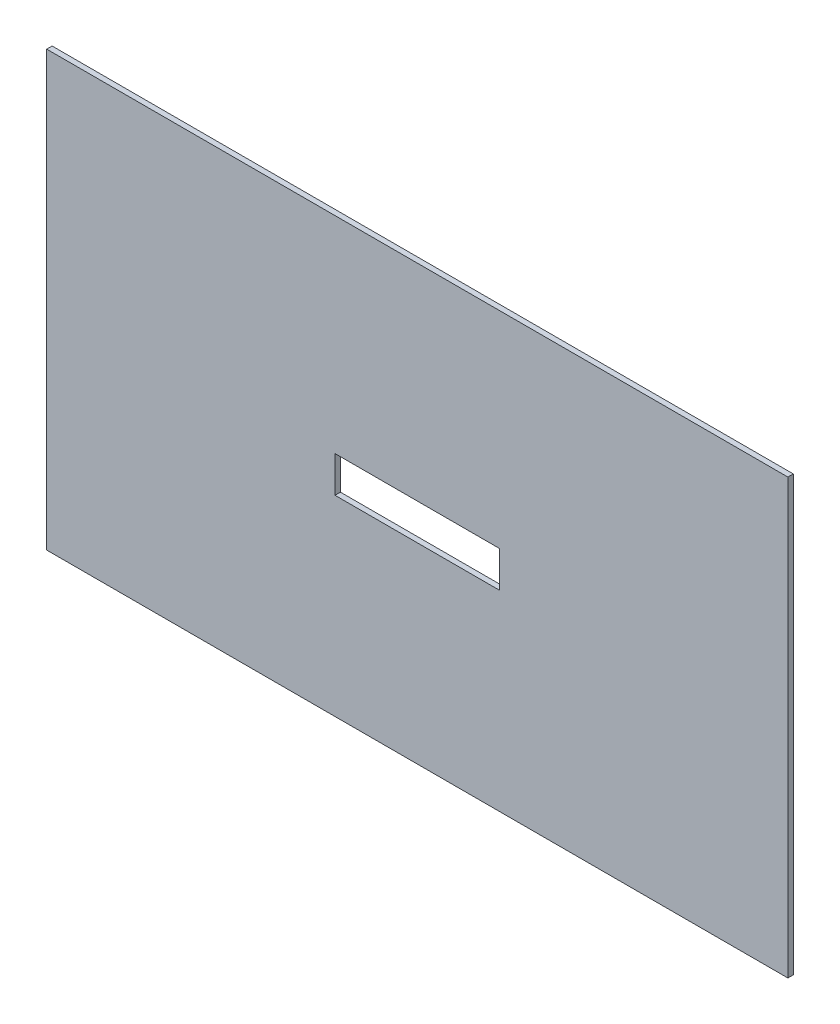
ISO-10303-21;
HEADER;
FILE_DESCRIPTION(('STEP AP214'),'2;1');
FILE_NAME('part.step','',(''),(''),'','','');
FILE_SCHEMA(('AUTOMOTIVE_DESIGN { 1 0 10303 214 1 1 1 1 }'));
ENDSEC;
DATA;
#1=APPLICATION_CONTEXT('core data for automotive mechanical design processes');
#2=APPLICATION_PROTOCOL_DEFINITION('international standard','automotive_design',2000,#1);
#3=PRODUCT_CONTEXT('',#1,'mechanical');
#4=PRODUCT('Part','Part','',(#3));
#5=PRODUCT_RELATED_PRODUCT_CATEGORY('part','',(#4));
#6=PRODUCT_DEFINITION_FORMATION('','',#4);
#7=PRODUCT_DEFINITION_CONTEXT('part definition',#1,'design');
#8=PRODUCT_DEFINITION('design','',#6,#7);
#9=PRODUCT_DEFINITION_SHAPE('','',#8);
#10=(LENGTH_UNIT() NAMED_UNIT(*) SI_UNIT(.MILLI.,.METRE.));
#11=(NAMED_UNIT(*) PLANE_ANGLE_UNIT() SI_UNIT($,.RADIAN.));
#12=(NAMED_UNIT(*) SI_UNIT($,.STERADIAN.) SOLID_ANGLE_UNIT());
#13=UNCERTAINTY_MEASURE_WITH_UNIT(LENGTH_MEASURE(1.E-05),#10,'distance_accuracy_value','');
#14=(GEOMETRIC_REPRESENTATION_CONTEXT(3) GLOBAL_UNCERTAINTY_ASSIGNED_CONTEXT((#13)) GLOBAL_UNIT_ASSIGNED_CONTEXT((#10,
#11,#12)) REPRESENTATION_CONTEXT('',''));
#15=CARTESIAN_POINT('',(0.,0.,0.));
#16=DIRECTION('',(0.,0.,1.));
#17=DIRECTION('',(1.,0.,0.));
#18=AXIS2_PLACEMENT_3D('',#15,#16,#17);
#19=CARTESIAN_POINT('',(205.,-120.,1.5));
#20=DIRECTION('',(-1.,0.,0.));
#21=DIRECTION('',(0.,0.,1.));
#22=AXIS2_PLACEMENT_3D('',#19,#20,#21);
#23=PLANE('',#22);
#24=DIRECTION('',(0.,1.,0.));
#25=VECTOR('',#24,1.);
#26=CARTESIAN_POINT('',(205.,-120.,-1.5));
#27=LINE('',#26,#25);
#28=CARTESIAN_POINT('',(205.,-120.,-1.5));
#29=VERTEX_POINT('',#28);
#30=CARTESIAN_POINT('',(205.,120.,-1.5));
#31=VERTEX_POINT('',#30);
#32=EDGE_CURVE('E149',#29,#31,#27,.T.);
#33=ORIENTED_EDGE('',*,*,#32,.T.);
#34=DIRECTION('',(0.,0.,-1.));
#35=VECTOR('',#34,1.);
#36=CARTESIAN_POINT('',(205.,120.,1.5));
#37=LINE('',#36,#35);
#38=CARTESIAN_POINT('',(205.,120.,1.5));
#39=VERTEX_POINT('',#38);
#40=EDGE_CURVE('E11',#39,#31,#37,.T.);
#41=ORIENTED_EDGE('',*,*,#40,.F.);
#42=DIRECTION('',(0.,1.,0.));
#43=VECTOR('',#42,1.);
#44=CARTESIAN_POINT('',(205.,-120.,1.5));
#45=LINE('',#44,#43);
#46=CARTESIAN_POINT('',(205.,-120.,1.5));
#47=VERTEX_POINT('',#46);
#48=EDGE_CURVE('E155',#47,#39,#45,.T.);
#49=ORIENTED_EDGE('',*,*,#48,.F.);
#50=DIRECTION('',(0.,0.,-1.));
#51=VECTOR('',#50,1.);
#52=CARTESIAN_POINT('',(205.,-120.,1.5));
#53=LINE('',#52,#51);
#54=EDGE_CURVE('E169',#47,#29,#53,.T.);
#55=ORIENTED_EDGE('',*,*,#54,.T.);
#56=EDGE_LOOP('',(#33,#41,#49,#55));
#57=FACE_BOUND('',#56,.T.);
#58=ADVANCED_FACE('F41',(#57),#23,.F.);
#59=CARTESIAN_POINT('',(-205.,120.,1.5));
#60=DIRECTION('',(0.,-1.,0.));
#61=DIRECTION('',(0.,0.,-1.));
#62=AXIS2_PLACEMENT_3D('',#59,#60,#61);
#63=PLANE('',#62);
#64=DIRECTION('',(-1.,0.,0.));
#65=VECTOR('',#64,1.);
#66=CARTESIAN_POINT('',(-205.,120.,-1.5));
#67=LINE('',#66,#65);
#68=CARTESIAN_POINT('',(-205.,120.,-1.5));
#69=VERTEX_POINT('',#68);
#70=EDGE_CURVE('E173',#31,#69,#67,.T.);
#71=ORIENTED_EDGE('',*,*,#70,.T.);
#72=DIRECTION('',(0.,0.,-1.));
#73=VECTOR('',#72,1.);
#74=CARTESIAN_POINT('',(-205.,120.,1.5));
#75=LINE('',#74,#73);
#76=CARTESIAN_POINT('',(-205.,120.,1.5));
#77=VERTEX_POINT('',#76);
#78=EDGE_CURVE('E49',#77,#69,#75,.T.);
#79=ORIENTED_EDGE('',*,*,#78,.F.);
#80=DIRECTION('',(-1.,0.,0.));
#81=VECTOR('',#80,1.);
#82=CARTESIAN_POINT('',(-205.,120.,1.5));
#83=LINE('',#82,#81);
#84=EDGE_CURVE('E159',#39,#77,#83,.T.);
#85=ORIENTED_EDGE('',*,*,#84,.F.);
#86=ORIENTED_EDGE('',*,*,#40,.T.);
#87=EDGE_LOOP('',(#71,#79,#85,#86));
#88=FACE_BOUND('',#87,.T.);
#89=ADVANCED_FACE('F207',(#88),#63,.F.);
#90=CARTESIAN_POINT('',(-205.,-120.,1.5));
#91=DIRECTION('',(1.,0.,0.));
#92=DIRECTION('',(0.,0.,-1.));
#93=AXIS2_PLACEMENT_3D('',#90,#91,#92);
#94=PLANE('',#93);
#95=DIRECTION('',(0.,-1.,0.));
#96=VECTOR('',#95,1.);
#97=CARTESIAN_POINT('',(-205.,-120.,-1.5));
#98=LINE('',#97,#96);
#99=CARTESIAN_POINT('',(-205.,-120.,-1.5));
#100=VERTEX_POINT('',#99);
#101=EDGE_CURVE('E176',#69,#100,#98,.T.);
#102=ORIENTED_EDGE('',*,*,#101,.T.);
#103=DIRECTION('',(0.,0.,-1.));
#104=VECTOR('',#103,1.);
#105=CARTESIAN_POINT('',(-205.,-120.,1.5));
#106=LINE('',#105,#104);
#107=CARTESIAN_POINT('',(-205.,-120.,1.5));
#108=VERTEX_POINT('',#107);
#109=EDGE_CURVE('E184',#108,#100,#106,.T.);
#110=ORIENTED_EDGE('',*,*,#109,.F.);
#111=DIRECTION('',(0.,-1.,0.));
#112=VECTOR('',#111,1.);
#113=CARTESIAN_POINT('',(-205.,-120.,1.5));
#114=LINE('',#113,#112);
#115=EDGE_CURVE('E163',#77,#108,#114,.T.);
#116=ORIENTED_EDGE('',*,*,#115,.F.);
#117=ORIENTED_EDGE('',*,*,#78,.T.);
#118=EDGE_LOOP('',(#102,#110,#116,#117));
#119=FACE_BOUND('',#118,.T.);
#120=ADVANCED_FACE('F193',(#119),#94,.F.);
#121=CARTESIAN_POINT('',(-205.,-120.,1.5));
#122=DIRECTION('',(0.,1.,0.));
#123=DIRECTION('',(0.,0.,1.));
#124=AXIS2_PLACEMENT_3D('',#121,#122,#123);
#125=PLANE('',#124);
#126=DIRECTION('',(1.,0.,0.));
#127=VECTOR('',#126,1.);
#128=CARTESIAN_POINT('',(-205.,-120.,-1.5));
#129=LINE('',#128,#127);
#130=EDGE_CURVE('E160',#100,#29,#129,.T.);
#131=ORIENTED_EDGE('',*,*,#130,.T.);
#132=ORIENTED_EDGE('',*,*,#54,.F.);
#133=DIRECTION('',(1.,0.,0.));
#134=VECTOR('',#133,1.);
#135=CARTESIAN_POINT('',(-205.,-120.,1.5));
#136=LINE('',#135,#134);
#137=EDGE_CURVE('E166',#108,#47,#136,.T.);
#138=ORIENTED_EDGE('',*,*,#137,.F.);
#139=ORIENTED_EDGE('',*,*,#109,.T.);
#140=EDGE_LOOP('',(#131,#132,#138,#139));
#141=FACE_BOUND('',#140,.T.);
#142=ADVANCED_FACE('F200',(#141),#125,.F.);
#143=CARTESIAN_POINT('',(0.,0.,1.5));
#144=DIRECTION('',(0.,0.,-1.));
#145=DIRECTION('',(-1.,0.,0.));
#146=AXIS2_PLACEMENT_3D('',#143,#144,#145);
#147=PLANE('',#146);
#148=DIRECTION('',(-1.,0.,0.));
#149=VECTOR('',#148,1.);
#150=CARTESIAN_POINT('',(-45.5,6.00000000000002,1.5));
#151=LINE('',#150,#149);
#152=CARTESIAN_POINT('',(45.5,6.00000000000002,1.5));
#153=VERTEX_POINT('',#152);
#154=CARTESIAN_POINT('',(-45.5,6.00000000000002,1.5));
#155=VERTEX_POINT('',#154);
#156=EDGE_CURVE('E140',#153,#155,#151,.T.);
#157=ORIENTED_EDGE('',*,*,#156,.F.);
#158=DIRECTION('',(0.,1.,0.));
#159=VECTOR('',#158,1.);
#160=CARTESIAN_POINT('',(45.5,-14.,1.5));
#161=LINE('',#160,#159);
#162=CARTESIAN_POINT('',(45.5,-14.,1.5));
#163=VERTEX_POINT('',#162);
#164=EDGE_CURVE('E56',#163,#153,#161,.T.);
#165=ORIENTED_EDGE('',*,*,#164,.F.);
#166=DIRECTION('',(1.,0.,0.));
#167=VECTOR('',#166,1.);
#168=CARTESIAN_POINT('',(-45.5,-14.,1.5));
#169=LINE('',#168,#167);
#170=CARTESIAN_POINT('',(-45.5,-14.,1.5));
#171=VERTEX_POINT('',#170);
#172=EDGE_CURVE('E127',#171,#163,#169,.T.);
#173=ORIENTED_EDGE('',*,*,#172,.F.);
#174=DIRECTION('',(0.,-1.,0.));
#175=VECTOR('',#174,1.);
#176=CARTESIAN_POINT('',(-45.5,-14.,1.5));
#177=LINE('',#176,#175);
#178=EDGE_CURVE('E131',#155,#171,#177,.T.);
#179=ORIENTED_EDGE('',*,*,#178,.F.);
#180=EDGE_LOOP('',(#157,#165,#173,#179));
#181=FACE_BOUND('',#180,.T.);
#182=ORIENTED_EDGE('',*,*,#48,.T.);
#183=ORIENTED_EDGE('',*,*,#84,.T.);
#184=ORIENTED_EDGE('',*,*,#115,.T.);
#185=ORIENTED_EDGE('',*,*,#137,.T.);
#186=EDGE_LOOP('',(#182,#183,#184,#185));
#187=FACE_BOUND('',#186,.T.);
#188=ADVANCED_FACE('F206',(#181,#187),#147,.F.);
#189=CARTESIAN_POINT('',(0.,0.,-1.5));
#190=DIRECTION('',(0.,0.,-1.));
#191=DIRECTION('',(-1.,0.,0.));
#192=AXIS2_PLACEMENT_3D('',#189,#190,#191);
#193=PLANE('',#192);
#194=DIRECTION('',(0.,1.,0.));
#195=VECTOR('',#194,1.);
#196=CARTESIAN_POINT('',(45.5,-14.,-1.5));
#197=LINE('',#196,#195);
#198=CARTESIAN_POINT('',(45.5,-14.,-1.5));
#199=VERTEX_POINT('',#198);
#200=CARTESIAN_POINT('',(45.5,6.00000000000002,-1.5));
#201=VERTEX_POINT('',#200);
#202=EDGE_CURVE('E108',#199,#201,#197,.T.);
#203=ORIENTED_EDGE('',*,*,#202,.T.);
#204=DIRECTION('',(-1.,0.,0.));
#205=VECTOR('',#204,1.);
#206=CARTESIAN_POINT('',(-45.5,6.00000000000002,-1.5));
#207=LINE('',#206,#205);
#208=CARTESIAN_POINT('',(-45.5,6.00000000000002,-1.5));
#209=VERTEX_POINT('',#208);
#210=EDGE_CURVE('E118',#201,#209,#207,.T.);
#211=ORIENTED_EDGE('',*,*,#210,.T.);
#212=DIRECTION('',(0.,-1.,0.));
#213=VECTOR('',#212,1.);
#214=CARTESIAN_POINT('',(-45.5,-14.,-1.5));
#215=LINE('',#214,#213);
#216=CARTESIAN_POINT('',(-45.5,-14.,-1.5));
#217=VERTEX_POINT('',#216);
#218=EDGE_CURVE('E64',#209,#217,#215,.T.);
#219=ORIENTED_EDGE('',*,*,#218,.T.);
#220=DIRECTION('',(1.,0.,0.));
#221=VECTOR('',#220,1.);
#222=CARTESIAN_POINT('',(-45.5,-14.,-1.5));
#223=LINE('',#222,#221);
#224=EDGE_CURVE('E115',#217,#199,#223,.T.);
#225=ORIENTED_EDGE('',*,*,#224,.T.);
#226=EDGE_LOOP('',(#203,#211,#219,#225));
#227=FACE_BOUND('',#226,.T.);
#228=ORIENTED_EDGE('',*,*,#32,.F.);
#229=ORIENTED_EDGE('',*,*,#130,.F.);
#230=ORIENTED_EDGE('',*,*,#101,.F.);
#231=ORIENTED_EDGE('',*,*,#70,.F.);
#232=EDGE_LOOP('',(#228,#229,#230,#231));
#233=FACE_BOUND('',#232,.T.);
#234=ADVANCED_FACE('F123',(#227,#233),#193,.T.);
#235=CARTESIAN_POINT('',(45.5,-14.,-1.5));
#236=DIRECTION('',(1.,0.,0.));
#237=DIRECTION('',(0.,0.,-1.));
#238=AXIS2_PLACEMENT_3D('',#235,#236,#237);
#239=PLANE('',#238);
#240=ORIENTED_EDGE('',*,*,#164,.T.);
#241=DIRECTION('',(0.,0.,1.));
#242=VECTOR('',#241,1.);
#243=CARTESIAN_POINT('',(45.5,6.00000000000002,-1.5));
#244=LINE('',#243,#242);
#245=EDGE_CURVE('E104',#201,#153,#244,.T.);
#246=ORIENTED_EDGE('',*,*,#245,.F.);
#247=ORIENTED_EDGE('',*,*,#202,.F.);
#248=DIRECTION('',(0.,0.,1.));
#249=VECTOR('',#248,1.);
#250=CARTESIAN_POINT('',(45.5,-14.,-1.5));
#251=LINE('',#250,#249);
#252=EDGE_CURVE('E146',#199,#163,#251,.T.);
#253=ORIENTED_EDGE('',*,*,#252,.T.);
#254=EDGE_LOOP('',(#240,#246,#247,#253));
#255=FACE_BOUND('',#254,.T.);
#256=ADVANCED_FACE('F106',(#255),#239,.F.);
#257=CARTESIAN_POINT('',(-45.5,-14.,-1.5));
#258=DIRECTION('',(0.,-1.,0.));
#259=DIRECTION('',(0.,0.,-1.));
#260=AXIS2_PLACEMENT_3D('',#257,#258,#259);
#261=PLANE('',#260);
#262=ORIENTED_EDGE('',*,*,#172,.T.);
#263=ORIENTED_EDGE('',*,*,#252,.F.);
#264=ORIENTED_EDGE('',*,*,#224,.F.);
#265=DIRECTION('',(0.,0.,1.));
#266=VECTOR('',#265,1.);
#267=CARTESIAN_POINT('',(-45.5,-14.,-1.5));
#268=LINE('',#267,#266);
#269=EDGE_CURVE('E150',#217,#171,#268,.T.);
#270=ORIENTED_EDGE('',*,*,#269,.T.);
#271=EDGE_LOOP('',(#262,#263,#264,#270));
#272=FACE_BOUND('',#271,.T.);
#273=ADVANCED_FACE('F224',(#272),#261,.F.);
#274=CARTESIAN_POINT('',(-45.5,-14.,-1.5));
#275=DIRECTION('',(-1.,0.,0.));
#276=DIRECTION('',(0.,0.,1.));
#277=AXIS2_PLACEMENT_3D('',#274,#275,#276);
#278=PLANE('',#277);
#279=ORIENTED_EDGE('',*,*,#178,.T.);
#280=ORIENTED_EDGE('',*,*,#269,.F.);
#281=ORIENTED_EDGE('',*,*,#218,.F.);
#282=DIRECTION('',(0.,0.,1.));
#283=VECTOR('',#282,1.);
#284=CARTESIAN_POINT('',(-45.5,6.00000000000002,-1.5));
#285=LINE('',#284,#283);
#286=EDGE_CURVE('E114',#209,#155,#285,.T.);
#287=ORIENTED_EDGE('',*,*,#286,.T.);
#288=EDGE_LOOP('',(#279,#280,#281,#287));
#289=FACE_BOUND('',#288,.T.);
#290=ADVANCED_FACE('F227',(#289),#278,.F.);
#291=CARTESIAN_POINT('',(-45.5,6.00000000000002,-1.5));
#292=DIRECTION('',(0.,1.,0.));
#293=DIRECTION('',(0.,0.,1.));
#294=AXIS2_PLACEMENT_3D('',#291,#292,#293);
#295=PLANE('',#294);
#296=ORIENTED_EDGE('',*,*,#156,.T.);
#297=ORIENTED_EDGE('',*,*,#286,.F.);
#298=ORIENTED_EDGE('',*,*,#210,.F.);
#299=ORIENTED_EDGE('',*,*,#245,.T.);
#300=EDGE_LOOP('',(#296,#297,#298,#299));
#301=FACE_BOUND('',#300,.T.);
#302=ADVANCED_FACE('F119',(#301),#295,.F.);
#303=CLOSED_SHELL('',(#58,#89,#120,#142,#188,#234,#256,#273,#290,#302));
#304=MANIFOLD_SOLID_BREP('B2',#303);
#305=ADVANCED_BREP_SHAPE_REPRESENTATION('',(#18,#304),#14);
#306=SHAPE_DEFINITION_REPRESENTATION(#9,#305);
ENDSEC;
END-ISO-10303-21;
